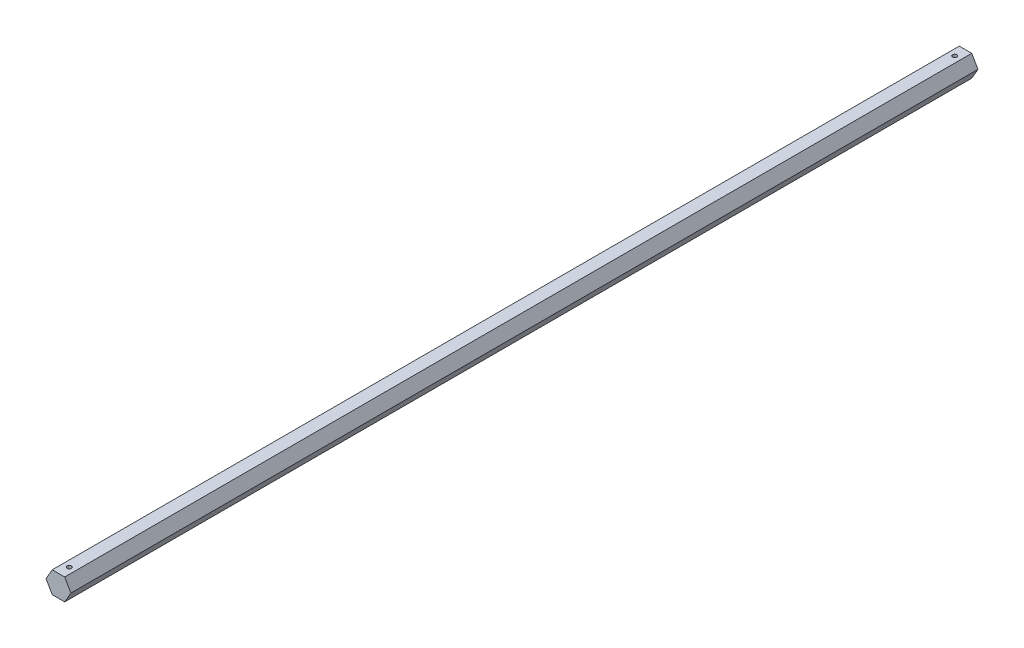
ISO-10303-21;
HEADER;
FILE_DESCRIPTION(('STEP AP214'),'2;1');
FILE_NAME('part.step','',(''),(''),'','','');
FILE_SCHEMA(('AUTOMOTIVE_DESIGN { 1 0 10303 214 1 1 1 1 }'));
ENDSEC;
DATA;
#1=APPLICATION_CONTEXT('core data for automotive mechanical design processes');
#2=APPLICATION_PROTOCOL_DEFINITION('international standard','automotive_design',2000,#1);
#3=PRODUCT_CONTEXT('',#1,'mechanical');
#4=PRODUCT('Part','Part','',(#3));
#5=PRODUCT_RELATED_PRODUCT_CATEGORY('part','',(#4));
#6=PRODUCT_DEFINITION_FORMATION('','',#4);
#7=PRODUCT_DEFINITION_CONTEXT('part definition',#1,'design');
#8=PRODUCT_DEFINITION('design','',#6,#7);
#9=PRODUCT_DEFINITION_SHAPE('','',#8);
#10=(LENGTH_UNIT() NAMED_UNIT(*) SI_UNIT(.MILLI.,.METRE.));
#11=(NAMED_UNIT(*) PLANE_ANGLE_UNIT() SI_UNIT($,.RADIAN.));
#12=(NAMED_UNIT(*) SI_UNIT($,.STERADIAN.) SOLID_ANGLE_UNIT());
#13=UNCERTAINTY_MEASURE_WITH_UNIT(LENGTH_MEASURE(1.E-05),#10,'distance_accuracy_value','');
#14=(GEOMETRIC_REPRESENTATION_CONTEXT(3) GLOBAL_UNCERTAINTY_ASSIGNED_CONTEXT((#13)) GLOBAL_UNIT_ASSIGNED_CONTEXT((#10,
#11,#12)) REPRESENTATION_CONTEXT('',''));
#15=CARTESIAN_POINT('',(0.,0.,0.));
#16=DIRECTION('',(0.,0.,1.));
#17=DIRECTION('',(1.,0.,0.));
#18=AXIS2_PLACEMENT_3D('',#15,#16,#17);
#19=CARTESIAN_POINT('',(-3.66617420935412,-6.35,266.7));
#20=DIRECTION('',(0.,1.,0.));
#21=DIRECTION('',(-1.,0.,0.));
#22=AXIS2_PLACEMENT_3D('',#19,#20,#21);
#23=PLANE('',#22);
#24=CARTESIAN_POINT('',(0.,-6.35,260.35));
#25=DIRECTION('',(0.,1.,0.));
#26=DIRECTION('',(-1.,0.,0.));
#27=AXIS2_PLACEMENT_3D('',#24,#25,#26);
#28=CIRCLE('',#27,1.2573);
#29=CARTESIAN_POINT('',(-1.2573,-6.35,260.35));
#30=VERTEX_POINT('',#29);
#31=EDGE_CURVE('E123',#30,#30,#28,.T.);
#32=ORIENTED_EDGE('',*,*,#31,.T.);
#33=EDGE_LOOP('',(#32));
#34=FACE_BOUND('',#33,.T.);
#35=CARTESIAN_POINT('',(0.,-6.35,-260.35));
#36=DIRECTION('',(0.,1.,0.));
#37=DIRECTION('',(1.,0.,0.));
#38=AXIS2_PLACEMENT_3D('',#35,#36,#37);
#39=CIRCLE('',#38,1.2573);
#40=CARTESIAN_POINT('',(1.2573,-6.35,-260.35));
#41=VERTEX_POINT('',#40);
#42=EDGE_CURVE('E164',#41,#41,#39,.T.);
#43=ORIENTED_EDGE('',*,*,#42,.T.);
#44=EDGE_LOOP('',(#43));
#45=FACE_BOUND('',#44,.T.);
#46=DIRECTION('',(1.,0.,0.));
#47=VECTOR('',#46,1.);
#48=CARTESIAN_POINT('',(-3.66617420935412,-6.35,-266.7));
#49=LINE('',#48,#47);
#50=CARTESIAN_POINT('',(-3.66617420935412,-6.35,-266.7));
#51=VERTEX_POINT('',#50);
#52=CARTESIAN_POINT('',(3.66617420935412,-6.35,-266.7));
#53=VERTEX_POINT('',#52);
#54=EDGE_CURVE('E119',#51,#53,#49,.T.);
#55=ORIENTED_EDGE('',*,*,#54,.T.);
#56=DIRECTION('',(0.,0.,-1.));
#57=VECTOR('',#56,1.);
#58=CARTESIAN_POINT('',(3.66617420935412,-6.35,266.7));
#59=LINE('',#58,#57);
#60=CARTESIAN_POINT('',(3.66617420935412,-6.35,266.7));
#61=VERTEX_POINT('',#60);
#62=EDGE_CURVE('E11',#61,#53,#59,.T.);
#63=ORIENTED_EDGE('',*,*,#62,.F.);
#64=DIRECTION('',(1.,0.,0.));
#65=VECTOR('',#64,1.);
#66=CARTESIAN_POINT('',(-3.66617420935412,-6.35,266.7));
#67=LINE('',#66,#65);
#68=CARTESIAN_POINT('',(-3.66617420935412,-6.35,266.7));
#69=VERTEX_POINT('',#68);
#70=EDGE_CURVE('E130',#69,#61,#67,.T.);
#71=ORIENTED_EDGE('',*,*,#70,.F.);
#72=DIRECTION('',(0.,0.,-1.));
#73=VECTOR('',#72,1.);
#74=CARTESIAN_POINT('',(-3.66617420935412,-6.35,266.7));
#75=LINE('',#74,#73);
#76=EDGE_CURVE('E115',#69,#51,#75,.T.);
#77=ORIENTED_EDGE('',*,*,#76,.T.);
#78=EDGE_LOOP('',(#55,#63,#71,#77));
#79=FACE_BOUND('',#78,.T.);
#80=ADVANCED_FACE('F35',(#34,#45,#79),#23,.F.);
#81=CARTESIAN_POINT('',(3.66617420935412,-6.35,266.7));
#82=DIRECTION('',(-0.866025403784439,0.5,0.));
#83=DIRECTION('',(-0.5,-0.866025403784438,0.));
#84=AXIS2_PLACEMENT_3D('',#81,#82,#83);
#85=PLANE('',#84);
#86=DIRECTION('',(0.5,0.866025403784438,0.));
#87=VECTOR('',#86,1.);
#88=CARTESIAN_POINT('',(3.66617420935412,-6.35,-266.7));
#89=LINE('',#88,#87);
#90=CARTESIAN_POINT('',(7.33234841870825,0.,-266.7));
#91=VERTEX_POINT('',#90);
#92=EDGE_CURVE('E122',#53,#91,#89,.T.);
#93=ORIENTED_EDGE('',*,*,#92,.T.);
#94=DIRECTION('',(0.,0.,-1.));
#95=VECTOR('',#94,1.);
#96=CARTESIAN_POINT('',(7.33234841870825,0.,266.7));
#97=LINE('',#96,#95);
#98=CARTESIAN_POINT('',(7.33234841870825,0.,266.7));
#99=VERTEX_POINT('',#98);
#100=EDGE_CURVE('E43',#99,#91,#97,.T.);
#101=ORIENTED_EDGE('',*,*,#100,.F.);
#102=DIRECTION('',(0.5,0.866025403784438,0.));
#103=VECTOR('',#102,1.);
#104=CARTESIAN_POINT('',(3.66617420935412,-6.35,266.7));
#105=LINE('',#104,#103);
#106=EDGE_CURVE('E88',#61,#99,#105,.T.);
#107=ORIENTED_EDGE('',*,*,#106,.F.);
#108=ORIENTED_EDGE('',*,*,#62,.T.);
#109=EDGE_LOOP('',(#93,#101,#107,#108));
#110=FACE_BOUND('',#109,.T.);
#111=ADVANCED_FACE('F154',(#110),#85,.F.);
#112=CARTESIAN_POINT('',(7.33234841870825,0.,266.7));
#113=DIRECTION('',(-0.866025403784438,-0.5,0.));
#114=DIRECTION('',(0.5,-0.866025403784439,0.));
#115=AXIS2_PLACEMENT_3D('',#112,#113,#114);
#116=PLANE('',#115);
#117=DIRECTION('',(-0.5,0.866025403784438,0.));
#118=VECTOR('',#117,1.);
#119=CARTESIAN_POINT('',(7.33234841870825,0.,-266.7));
#120=LINE('',#119,#118);
#121=CARTESIAN_POINT('',(3.66617420935412,6.35,-266.7));
#122=VERTEX_POINT('',#121);
#123=EDGE_CURVE('E125',#91,#122,#120,.T.);
#124=ORIENTED_EDGE('',*,*,#123,.T.);
#125=DIRECTION('',(0.,0.,-1.));
#126=VECTOR('',#125,1.);
#127=CARTESIAN_POINT('',(3.66617420935412,6.35,266.7));
#128=LINE('',#127,#126);
#129=CARTESIAN_POINT('',(3.66617420935412,6.35,266.7));
#130=VERTEX_POINT('',#129);
#131=EDGE_CURVE('E110',#130,#122,#128,.T.);
#132=ORIENTED_EDGE('',*,*,#131,.F.);
#133=DIRECTION('',(-0.5,0.866025403784438,0.));
#134=VECTOR('',#133,1.);
#135=CARTESIAN_POINT('',(7.33234841870825,0.,266.7));
#136=LINE('',#135,#134);
#137=EDGE_CURVE('E101',#99,#130,#136,.T.);
#138=ORIENTED_EDGE('',*,*,#137,.F.);
#139=ORIENTED_EDGE('',*,*,#100,.T.);
#140=EDGE_LOOP('',(#124,#132,#138,#139));
#141=FACE_BOUND('',#140,.T.);
#142=ADVANCED_FACE('F136',(#141),#116,.F.);
#143=CARTESIAN_POINT('',(3.66617420935412,6.35,266.7));
#144=DIRECTION('',(0.,-1.,0.));
#145=DIRECTION('',(0.,0.,-1.));
#146=AXIS2_PLACEMENT_3D('',#143,#144,#145);
#147=PLANE('',#146);
#148=CARTESIAN_POINT('',(0.,6.35,260.35));
#149=DIRECTION('',(0.,1.,0.));
#150=DIRECTION('',(-1.,0.,0.));
#151=AXIS2_PLACEMENT_3D('',#148,#149,#150);
#152=CIRCLE('',#151,1.2573);
#153=CARTESIAN_POINT('',(-1.2573,6.35,260.35));
#154=VERTEX_POINT('',#153);
#155=EDGE_CURVE('E166',#154,#154,#152,.T.);
#156=ORIENTED_EDGE('',*,*,#155,.F.);
#157=EDGE_LOOP('',(#156));
#158=FACE_BOUND('',#157,.T.);
#159=CARTESIAN_POINT('',(0.,6.35,-260.35));
#160=DIRECTION('',(0.,1.,0.));
#161=DIRECTION('',(1.,0.,0.));
#162=AXIS2_PLACEMENT_3D('',#159,#160,#161);
#163=CIRCLE('',#162,1.2573);
#164=CARTESIAN_POINT('',(1.2573,6.35,-260.35));
#165=VERTEX_POINT('',#164);
#166=EDGE_CURVE('E167',#165,#165,#163,.T.);
#167=ORIENTED_EDGE('',*,*,#166,.F.);
#168=EDGE_LOOP('',(#167));
#169=FACE_BOUND('',#168,.T.);
#170=DIRECTION('',(-1.,0.,0.));
#171=VECTOR('',#170,1.);
#172=CARTESIAN_POINT('',(3.66617420935412,6.35,-266.7));
#173=LINE('',#172,#171);
#174=CARTESIAN_POINT('',(-3.66617420935412,6.35,-266.7));
#175=VERTEX_POINT('',#174);
#176=EDGE_CURVE('E109',#122,#175,#173,.T.);
#177=ORIENTED_EDGE('',*,*,#176,.T.);
#178=DIRECTION('',(0.,0.,-1.));
#179=VECTOR('',#178,1.);
#180=CARTESIAN_POINT('',(-3.66617420935412,6.35,266.7));
#181=LINE('',#180,#179);
#182=CARTESIAN_POINT('',(-3.66617420935412,6.35,266.7));
#183=VERTEX_POINT('',#182);
#184=EDGE_CURVE('E106',#183,#175,#181,.T.);
#185=ORIENTED_EDGE('',*,*,#184,.F.);
#186=DIRECTION('',(-1.,0.,0.));
#187=VECTOR('',#186,1.);
#188=CARTESIAN_POINT('',(3.66617420935412,6.35,266.7));
#189=LINE('',#188,#187);
#190=EDGE_CURVE('E95',#130,#183,#189,.T.);
#191=ORIENTED_EDGE('',*,*,#190,.F.);
#192=ORIENTED_EDGE('',*,*,#131,.T.);
#193=EDGE_LOOP('',(#177,#185,#191,#192));
#194=FACE_BOUND('',#193,.T.);
#195=ADVANCED_FACE('F107',(#158,#169,#194),#147,.F.);
#196=CARTESIAN_POINT('',(-3.66617420935412,6.35,266.7));
#197=DIRECTION('',(0.866025403784439,-0.5,0.));
#198=DIRECTION('',(0.5,0.866025403784439,0.));
#199=AXIS2_PLACEMENT_3D('',#196,#197,#198);
#200=PLANE('',#199);
#201=DIRECTION('',(-0.5,-0.866025403784439,0.));
#202=VECTOR('',#201,1.);
#203=CARTESIAN_POINT('',(-3.66617420935412,6.35,-266.7));
#204=LINE('',#203,#202);
#205=CARTESIAN_POINT('',(-7.33234841870825,0.,-266.7));
#206=VERTEX_POINT('',#205);
#207=EDGE_CURVE('E74',#175,#206,#204,.T.);
#208=ORIENTED_EDGE('',*,*,#207,.T.);
#209=DIRECTION('',(0.,0.,-1.));
#210=VECTOR('',#209,1.);
#211=CARTESIAN_POINT('',(-7.33234841870825,0.,266.7));
#212=LINE('',#211,#210);
#213=CARTESIAN_POINT('',(-7.33234841870825,0.,266.7));
#214=VERTEX_POINT('',#213);
#215=EDGE_CURVE('E111',#214,#206,#212,.T.);
#216=ORIENTED_EDGE('',*,*,#215,.F.);
#217=DIRECTION('',(-0.5,-0.866025403784439,0.));
#218=VECTOR('',#217,1.);
#219=CARTESIAN_POINT('',(-3.66617420935412,6.35,266.7));
#220=LINE('',#219,#218);
#221=EDGE_CURVE('E99',#183,#214,#220,.T.);
#222=ORIENTED_EDGE('',*,*,#221,.F.);
#223=ORIENTED_EDGE('',*,*,#184,.T.);
#224=EDGE_LOOP('',(#208,#216,#222,#223));
#225=FACE_BOUND('',#224,.T.);
#226=ADVANCED_FACE('F113',(#225),#200,.F.);
#227=CARTESIAN_POINT('',(-7.33234841870825,0.,266.7));
#228=DIRECTION('',(0.866025403784439,0.5,0.));
#229=DIRECTION('',(-0.5,0.866025403784438,0.));
#230=AXIS2_PLACEMENT_3D('',#227,#228,#229);
#231=PLANE('',#230);
#232=DIRECTION('',(0.5,-0.866025403784438,0.));
#233=VECTOR('',#232,1.);
#234=CARTESIAN_POINT('',(-7.33234841870825,0.,-266.7));
#235=LINE('',#234,#233);
#236=EDGE_CURVE('E80',#206,#51,#235,.T.);
#237=ORIENTED_EDGE('',*,*,#236,.T.);
#238=ORIENTED_EDGE('',*,*,#76,.F.);
#239=DIRECTION('',(0.5,-0.866025403784438,0.));
#240=VECTOR('',#239,1.);
#241=CARTESIAN_POINT('',(-7.33234841870825,0.,266.7));
#242=LINE('',#241,#240);
#243=EDGE_CURVE('E51',#214,#69,#242,.T.);
#244=ORIENTED_EDGE('',*,*,#243,.F.);
#245=ORIENTED_EDGE('',*,*,#215,.T.);
#246=EDGE_LOOP('',(#237,#238,#244,#245));
#247=FACE_BOUND('',#246,.T.);
#248=ADVANCED_FACE('F143',(#247),#231,.F.);
#249=CARTESIAN_POINT('',(0.,0.,266.7));
#250=DIRECTION('',(0.,0.,1.));
#251=DIRECTION('',(1.,0.,0.));
#252=AXIS2_PLACEMENT_3D('',#249,#250,#251);
#253=PLANE('',#252);
#254=ORIENTED_EDGE('',*,*,#70,.T.);
#255=ORIENTED_EDGE('',*,*,#106,.T.);
#256=ORIENTED_EDGE('',*,*,#137,.T.);
#257=ORIENTED_EDGE('',*,*,#190,.T.);
#258=ORIENTED_EDGE('',*,*,#221,.T.);
#259=ORIENTED_EDGE('',*,*,#243,.T.);
#260=EDGE_LOOP('',(#254,#255,#256,#257,#258,#259));
#261=FACE_BOUND('',#260,.T.);
#262=ADVANCED_FACE('F97',(#261),#253,.T.);
#263=CARTESIAN_POINT('',(0.,0.,-266.7));
#264=DIRECTION('',(0.,0.,1.));
#265=DIRECTION('',(1.,0.,0.));
#266=AXIS2_PLACEMENT_3D('',#263,#264,#265);
#267=PLANE('',#266);
#268=ORIENTED_EDGE('',*,*,#54,.F.);
#269=ORIENTED_EDGE('',*,*,#236,.F.);
#270=ORIENTED_EDGE('',*,*,#207,.F.);
#271=ORIENTED_EDGE('',*,*,#176,.F.);
#272=ORIENTED_EDGE('',*,*,#123,.F.);
#273=ORIENTED_EDGE('',*,*,#92,.F.);
#274=EDGE_LOOP('',(#268,#269,#270,#271,#272,#273));
#275=FACE_BOUND('',#274,.T.);
#276=ADVANCED_FACE('F139',(#275),#267,.F.);
#277=CARTESIAN_POINT('',(0.,-6.35,-260.35));
#278=DIRECTION('',(0.,1.,0.));
#279=DIRECTION('',(-1.,0.,0.));
#280=AXIS2_PLACEMENT_3D('',#277,#278,#279);
#281=CYLINDRICAL_SURFACE('',#280,1.2573);
#282=ORIENTED_EDGE('',*,*,#42,.F.);
#283=EDGE_LOOP('',(#282));
#284=FACE_BOUND('',#283,.T.);
#285=ORIENTED_EDGE('',*,*,#166,.T.);
#286=EDGE_LOOP('',(#285));
#287=FACE_BOUND('',#286,.T.);
#288=ADVANCED_FACE('F178',(#284,#287),#281,.F.);
#289=CARTESIAN_POINT('',(0.,-6.35,260.35));
#290=DIRECTION('',(0.,1.,0.));
#291=DIRECTION('',(-1.,0.,0.));
#292=AXIS2_PLACEMENT_3D('',#289,#290,#291);
#293=CYLINDRICAL_SURFACE('',#292,1.2573);
#294=ORIENTED_EDGE('',*,*,#31,.F.);
#295=EDGE_LOOP('',(#294));
#296=FACE_BOUND('',#295,.T.);
#297=ORIENTED_EDGE('',*,*,#155,.T.);
#298=EDGE_LOOP('',(#297));
#299=FACE_BOUND('',#298,.T.);
#300=ADVANCED_FACE('F189',(#296,#299),#293,.F.);
#301=CLOSED_SHELL('',(#80,#111,#142,#195,#226,#248,#262,#276,#288,#300));
#302=MANIFOLD_SOLID_BREP('B2',#301);
#303=ADVANCED_BREP_SHAPE_REPRESENTATION('',(#18,#302),#14);
#304=SHAPE_DEFINITION_REPRESENTATION(#9,#303);
ENDSEC;
END-ISO-10303-21;
